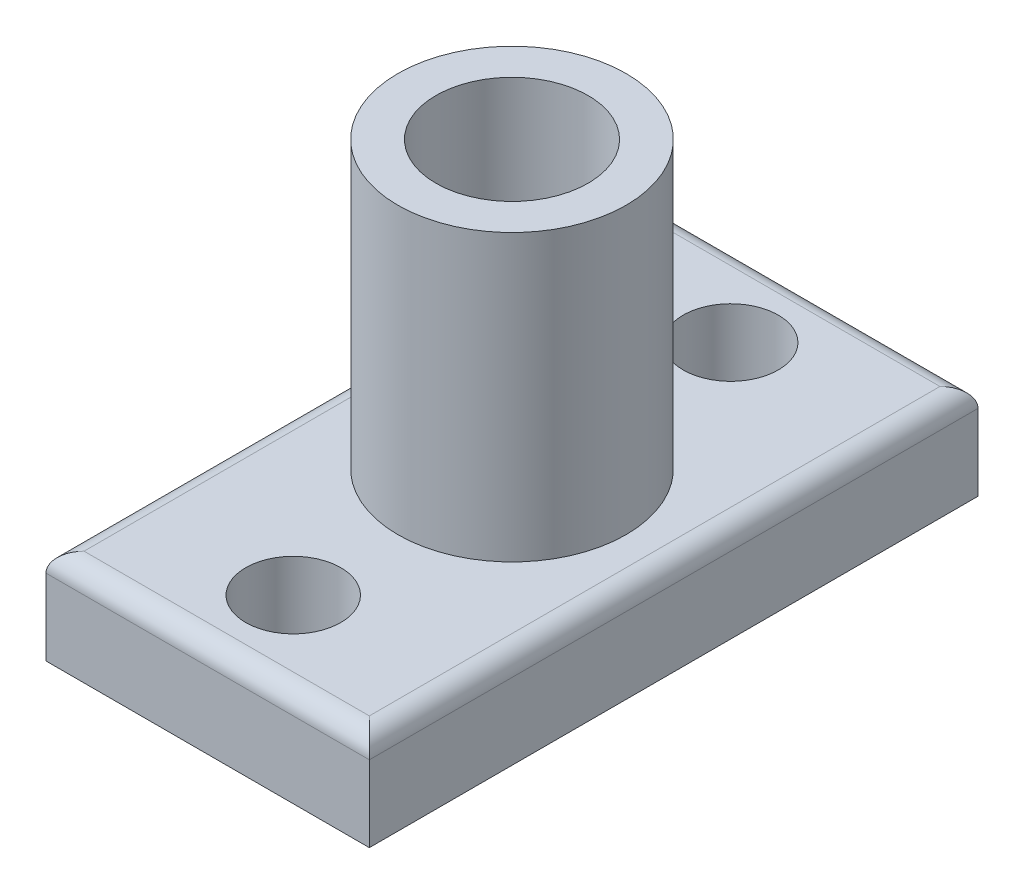
ISO-10303-21;
HEADER;
FILE_DESCRIPTION(('STEP AP214'),'2;1');
FILE_NAME('part.step','',(''),(''),'','','');
FILE_SCHEMA(('AUTOMOTIVE_DESIGN { 1 0 10303 214 1 1 1 1 }'));
ENDSEC;
DATA;
#1=APPLICATION_CONTEXT('core data for automotive mechanical design processes');
#2=APPLICATION_PROTOCOL_DEFINITION('international standard','automotive_design',2000,#1);
#3=PRODUCT_CONTEXT('',#1,'mechanical');
#4=PRODUCT('Part','Part','',(#3));
#5=PRODUCT_RELATED_PRODUCT_CATEGORY('part','',(#4));
#6=PRODUCT_DEFINITION_FORMATION('','',#4);
#7=PRODUCT_DEFINITION_CONTEXT('part definition',#1,'design');
#8=PRODUCT_DEFINITION('design','',#6,#7);
#9=PRODUCT_DEFINITION_SHAPE('','',#8);
#10=(LENGTH_UNIT() NAMED_UNIT(*) SI_UNIT(.MILLI.,.METRE.));
#11=(NAMED_UNIT(*) PLANE_ANGLE_UNIT() SI_UNIT($,.RADIAN.));
#12=(NAMED_UNIT(*) SI_UNIT($,.STERADIAN.) SOLID_ANGLE_UNIT());
#13=UNCERTAINTY_MEASURE_WITH_UNIT(LENGTH_MEASURE(1.E-05),#10,'distance_accuracy_value','');
#14=(GEOMETRIC_REPRESENTATION_CONTEXT(3) GLOBAL_UNCERTAINTY_ASSIGNED_CONTEXT((#13)) GLOBAL_UNIT_ASSIGNED_CONTEXT((#10,
#11,#12)) REPRESENTATION_CONTEXT('',''));
#15=CARTESIAN_POINT('',(0.,0.,0.));
#16=DIRECTION('',(0.,0.,1.));
#17=DIRECTION('',(1.,0.,0.));
#18=AXIS2_PLACEMENT_3D('',#15,#16,#17);
#19=CARTESIAN_POINT('',(0.,5.,0.));
#20=DIRECTION('',(0.,-1.,0.));
#21=DIRECTION('',(0.,0.,-1.));
#22=AXIS2_PLACEMENT_3D('',#19,#20,#21);
#23=PLANE('',#22);
#24=DIRECTION('',(-1.,0.,0.));
#25=VECTOR('',#24,1.);
#26=CARTESIAN_POINT('',(0.,5.,-15.));
#27=LINE('',#26,#25);
#28=CARTESIAN_POINT('',(7.5,5.,-15.));
#29=VERTEX_POINT('',#28);
#30=CARTESIAN_POINT('',(-7.5,5.,-15.));
#31=VERTEX_POINT('',#30);
#32=EDGE_CURVE('E130',#29,#31,#27,.T.);
#33=ORIENTED_EDGE('',*,*,#32,.T.);
#34=DIRECTION('',(0.,0.,1.));
#35=VECTOR('',#34,1.);
#36=CARTESIAN_POINT('',(-7.5,5.,0.));
#37=LINE('',#36,#35);
#38=CARTESIAN_POINT('',(-7.5,5.,15.));
#39=VERTEX_POINT('',#38);
#40=EDGE_CURVE('E133',#31,#39,#37,.T.);
#41=ORIENTED_EDGE('',*,*,#40,.T.);
#42=DIRECTION('',(1.,0.,0.));
#43=VECTOR('',#42,1.);
#44=CARTESIAN_POINT('',(0.,5.,15.));
#45=LINE('',#44,#43);
#46=CARTESIAN_POINT('',(7.5,5.,15.));
#47=VERTEX_POINT('',#46);
#48=EDGE_CURVE('E128',#39,#47,#45,.T.);
#49=ORIENTED_EDGE('',*,*,#48,.T.);
#50=DIRECTION('',(0.,0.,-1.));
#51=VECTOR('',#50,1.);
#52=CARTESIAN_POINT('',(7.5,5.,0.));
#53=LINE('',#52,#51);
#54=EDGE_CURVE('E126',#47,#29,#53,.T.);
#55=ORIENTED_EDGE('',*,*,#54,.T.);
#56=EDGE_LOOP('',(#33,#41,#49,#55));
#57=FACE_BOUND('',#56,.T.);
#58=CARTESIAN_POINT('',(0.,5.,0.));
#59=DIRECTION('',(0.,-1.,0.));
#60=DIRECTION('',(0.,0.,-1.));
#61=AXIS2_PLACEMENT_3D('',#58,#59,#60);
#62=CIRCLE('',#61,6.);
#63=CARTESIAN_POINT('',(0.,5.,-6.));
#64=VERTEX_POINT('',#63);
#65=EDGE_CURVE('E95',#64,#64,#62,.F.);
#66=ORIENTED_EDGE('',*,*,#65,.F.);
#67=EDGE_LOOP('',(#66));
#68=FACE_BOUND('',#67,.T.);
#69=CARTESIAN_POINT('',(0.,5.,-11.5));
#70=DIRECTION('',(0.,1.,0.));
#71=DIRECTION('',(0.,0.,1.));
#72=AXIS2_PLACEMENT_3D('',#69,#70,#71);
#73=CIRCLE('',#72,2.5);
#74=CARTESIAN_POINT('',(0.,5.,-9.));
#75=VERTEX_POINT('',#74);
#76=EDGE_CURVE('E110',#75,#75,#73,.T.);
#77=ORIENTED_EDGE('',*,*,#76,.F.);
#78=EDGE_LOOP('',(#77));
#79=FACE_BOUND('',#78,.T.);
#80=CARTESIAN_POINT('',(0.,5.,11.5));
#81=DIRECTION('',(0.,1.,0.));
#82=DIRECTION('',(0.,0.,1.));
#83=AXIS2_PLACEMENT_3D('',#80,#81,#82);
#84=CIRCLE('',#83,2.5);
#85=CARTESIAN_POINT('',(0.,5.,14.));
#86=VERTEX_POINT('',#85);
#87=EDGE_CURVE('E164',#86,#86,#84,.T.);
#88=ORIENTED_EDGE('',*,*,#87,.F.);
#89=EDGE_LOOP('',(#88));
#90=FACE_BOUND('',#89,.T.);
#91=ADVANCED_FACE('F32',(#57,#68,#79,#90),#23,.F.);
#92=CARTESIAN_POINT('',(0.,0.,0.));
#93=DIRECTION('',(0.,-1.,0.));
#94=DIRECTION('',(0.,0.,-1.));
#95=AXIS2_PLACEMENT_3D('',#92,#93,#94);
#96=PLANE('',#95);
#97=CARTESIAN_POINT('',(0.,0.,-11.5));
#98=DIRECTION('',(0.,1.,0.));
#99=DIRECTION('',(0.,0.,1.));
#100=AXIS2_PLACEMENT_3D('',#97,#98,#99);
#101=CIRCLE('',#100,2.5);
#102=CARTESIAN_POINT('',(0.,0.,-9.));
#103=VERTEX_POINT('',#102);
#104=EDGE_CURVE('E113',#103,#103,#101,.T.);
#105=ORIENTED_EDGE('',*,*,#104,.T.);
#106=EDGE_LOOP('',(#105));
#107=FACE_BOUND('',#106,.T.);
#108=DIRECTION('',(0.,0.,-1.));
#109=VECTOR('',#108,1.);
#110=CARTESIAN_POINT('',(8.5,0.,16.));
#111=LINE('',#110,#109);
#112=CARTESIAN_POINT('',(8.5,0.,16.));
#113=VERTEX_POINT('',#112);
#114=CARTESIAN_POINT('',(8.5,0.,-16.));
#115=VERTEX_POINT('',#114);
#116=EDGE_CURVE('E103',#113,#115,#111,.T.);
#117=ORIENTED_EDGE('',*,*,#116,.F.);
#118=DIRECTION('',(1.,0.,0.));
#119=VECTOR('',#118,1.);
#120=CARTESIAN_POINT('',(-8.5,0.,16.));
#121=LINE('',#120,#119);
#122=CARTESIAN_POINT('',(-8.5,0.,16.));
#123=VERTEX_POINT('',#122);
#124=EDGE_CURVE('E118',#123,#113,#121,.T.);
#125=ORIENTED_EDGE('',*,*,#124,.F.);
#126=DIRECTION('',(0.,0.,1.));
#127=VECTOR('',#126,1.);
#128=CARTESIAN_POINT('',(-8.5,0.,16.));
#129=LINE('',#128,#127);
#130=CARTESIAN_POINT('',(-8.5,0.,-16.));
#131=VERTEX_POINT('',#130);
#132=EDGE_CURVE('E105',#131,#123,#129,.T.);
#133=ORIENTED_EDGE('',*,*,#132,.F.);
#134=DIRECTION('',(-1.,0.,0.));
#135=VECTOR('',#134,1.);
#136=CARTESIAN_POINT('',(-8.5,0.,-16.));
#137=LINE('',#136,#135);
#138=EDGE_CURVE('E90',#115,#131,#137,.T.);
#139=ORIENTED_EDGE('',*,*,#138,.F.);
#140=EDGE_LOOP('',(#117,#125,#133,#139));
#141=FACE_BOUND('',#140,.T.);
#142=CARTESIAN_POINT('',(0.,0.,11.5));
#143=DIRECTION('',(0.,1.,0.));
#144=DIRECTION('',(0.,0.,1.));
#145=AXIS2_PLACEMENT_3D('',#142,#143,#144);
#146=CIRCLE('',#145,2.5);
#147=CARTESIAN_POINT('',(0.,0.,14.));
#148=VERTEX_POINT('',#147);
#149=EDGE_CURVE('E163',#148,#148,#146,.T.);
#150=ORIENTED_EDGE('',*,*,#149,.T.);
#151=EDGE_LOOP('',(#150));
#152=FACE_BOUND('',#151,.T.);
#153=ADVANCED_FACE('F100',(#107,#141,#152),#96,.T.);
#154=CARTESIAN_POINT('',(8.5,5.,16.));
#155=DIRECTION('',(-1.,0.,0.));
#156=DIRECTION('',(0.,0.,1.));
#157=AXIS2_PLACEMENT_3D('',#154,#155,#156);
#158=PLANE('',#157);
#159=DIRECTION('',(0.,-1.,0.));
#160=VECTOR('',#159,1.);
#161=CARTESIAN_POINT('',(8.5,5.,-16.));
#162=LINE('',#161,#160);
#163=CARTESIAN_POINT('',(8.5,4.,-16.));
#164=VERTEX_POINT('',#163);
#165=EDGE_CURVE('E86',#164,#115,#162,.T.);
#166=ORIENTED_EDGE('',*,*,#165,.F.);
#167=DIRECTION('',(0.,0.,-1.));
#168=VECTOR('',#167,1.);
#169=CARTESIAN_POINT('',(8.5,4.,16.));
#170=LINE('',#169,#168);
#171=CARTESIAN_POINT('',(8.5,4.,16.));
#172=VERTEX_POINT('',#171);
#173=EDGE_CURVE('E11',#164,#172,#170,.F.);
#174=ORIENTED_EDGE('',*,*,#173,.T.);
#175=DIRECTION('',(0.,-1.,0.));
#176=VECTOR('',#175,1.);
#177=CARTESIAN_POINT('',(8.5,5.,16.));
#178=LINE('',#177,#176);
#179=EDGE_CURVE('E108',#172,#113,#178,.T.);
#180=ORIENTED_EDGE('',*,*,#179,.T.);
#181=ORIENTED_EDGE('',*,*,#116,.T.);
#182=EDGE_LOOP('',(#166,#174,#180,#181));
#183=FACE_BOUND('',#182,.T.);
#184=ADVANCED_FACE('F107',(#183),#158,.F.);
#185=CARTESIAN_POINT('',(-8.5,5.,-16.));
#186=DIRECTION('',(0.,0.,1.));
#187=DIRECTION('',(1.,0.,0.));
#188=AXIS2_PLACEMENT_3D('',#185,#186,#187);
#189=PLANE('',#188);
#190=DIRECTION('',(0.,-1.,0.));
#191=VECTOR('',#190,1.);
#192=CARTESIAN_POINT('',(-8.5,5.,-16.));
#193=LINE('',#192,#191);
#194=CARTESIAN_POINT('',(-8.5,4.,-16.));
#195=VERTEX_POINT('',#194);
#196=EDGE_CURVE('E96',#195,#131,#193,.T.);
#197=ORIENTED_EDGE('',*,*,#196,.F.);
#198=DIRECTION('',(-1.,0.,0.));
#199=VECTOR('',#198,1.);
#200=CARTESIAN_POINT('',(-8.5,4.,-16.));
#201=LINE('',#200,#199);
#202=EDGE_CURVE('E93',#195,#164,#201,.F.);
#203=ORIENTED_EDGE('',*,*,#202,.T.);
#204=ORIENTED_EDGE('',*,*,#165,.T.);
#205=ORIENTED_EDGE('',*,*,#138,.T.);
#206=EDGE_LOOP('',(#197,#203,#204,#205));
#207=FACE_BOUND('',#206,.T.);
#208=ADVANCED_FACE('F89',(#207),#189,.F.);
#209=CARTESIAN_POINT('',(-8.5,5.,16.));
#210=DIRECTION('',(1.,0.,0.));
#211=DIRECTION('',(0.,0.,-1.));
#212=AXIS2_PLACEMENT_3D('',#209,#210,#211);
#213=PLANE('',#212);
#214=DIRECTION('',(0.,-1.,0.));
#215=VECTOR('',#214,1.);
#216=CARTESIAN_POINT('',(-8.5,5.,16.));
#217=LINE('',#216,#215);
#218=CARTESIAN_POINT('',(-8.5,4.,16.));
#219=VERTEX_POINT('',#218);
#220=EDGE_CURVE('E121',#219,#123,#217,.T.);
#221=ORIENTED_EDGE('',*,*,#220,.F.);
#222=DIRECTION('',(0.,0.,1.));
#223=VECTOR('',#222,1.);
#224=CARTESIAN_POINT('',(-8.5,4.,16.));
#225=LINE('',#224,#223);
#226=EDGE_CURVE('E41',#219,#195,#225,.F.);
#227=ORIENTED_EDGE('',*,*,#226,.T.);
#228=ORIENTED_EDGE('',*,*,#196,.T.);
#229=ORIENTED_EDGE('',*,*,#132,.T.);
#230=EDGE_LOOP('',(#221,#227,#228,#229));
#231=FACE_BOUND('',#230,.T.);
#232=ADVANCED_FACE('F264',(#231),#213,.F.);
#233=CARTESIAN_POINT('',(-8.5,5.,16.));
#234=DIRECTION('',(0.,0.,-1.));
#235=DIRECTION('',(-1.,0.,0.));
#236=AXIS2_PLACEMENT_3D('',#233,#234,#235);
#237=PLANE('',#236);
#238=ORIENTED_EDGE('',*,*,#179,.F.);
#239=DIRECTION('',(1.,0.,0.));
#240=VECTOR('',#239,1.);
#241=CARTESIAN_POINT('',(-8.5,4.,16.));
#242=LINE('',#241,#240);
#243=EDGE_CURVE('E49',#172,#219,#242,.F.);
#244=ORIENTED_EDGE('',*,*,#243,.T.);
#245=ORIENTED_EDGE('',*,*,#220,.T.);
#246=ORIENTED_EDGE('',*,*,#124,.T.);
#247=EDGE_LOOP('',(#238,#244,#245,#246));
#248=FACE_BOUND('',#247,.T.);
#249=ADVANCED_FACE('F183',(#248),#237,.F.);
#250=CARTESIAN_POINT('',(0.,5.,-11.5));
#251=DIRECTION('',(0.,-1.,0.));
#252=DIRECTION('',(0.,0.,-1.));
#253=AXIS2_PLACEMENT_3D('',#250,#251,#252);
#254=CYLINDRICAL_SURFACE('',#253,2.5);
#255=ORIENTED_EDGE('',*,*,#76,.T.);
#256=EDGE_LOOP('',(#255));
#257=FACE_BOUND('',#256,.T.);
#258=ORIENTED_EDGE('',*,*,#104,.F.);
#259=EDGE_LOOP('',(#258));
#260=FACE_BOUND('',#259,.T.);
#261=ADVANCED_FACE('F173',(#257,#260),#254,.F.);
#262=CARTESIAN_POINT('',(0.,5.,11.5));
#263=DIRECTION('',(0.,-1.,0.));
#264=DIRECTION('',(0.,0.,-1.));
#265=AXIS2_PLACEMENT_3D('',#262,#263,#264);
#266=CYLINDRICAL_SURFACE('',#265,2.5);
#267=ORIENTED_EDGE('',*,*,#87,.T.);
#268=EDGE_LOOP('',(#267));
#269=FACE_BOUND('',#268,.T.);
#270=ORIENTED_EDGE('',*,*,#149,.F.);
#271=EDGE_LOOP('',(#270));
#272=FACE_BOUND('',#271,.T.);
#273=ADVANCED_FACE('F170',(#269,#272),#266,.F.);
#274=CARTESIAN_POINT('',(0.,20.,0.));
#275=DIRECTION('',(0.,1.,0.));
#276=DIRECTION('',(0.,0.,1.));
#277=AXIS2_PLACEMENT_3D('',#274,#275,#276);
#278=PLANE('',#277);
#279=CARTESIAN_POINT('',(0.,20.,0.));
#280=DIRECTION('',(0.,1.,0.));
#281=DIRECTION('',(0.,0.,1.));
#282=AXIS2_PLACEMENT_3D('',#279,#280,#281);
#283=CIRCLE('',#282,6.);
#284=CARTESIAN_POINT('',(0.,20.,6.));
#285=VERTEX_POINT('',#284);
#286=EDGE_CURVE('E158',#285,#285,#283,.T.);
#287=ORIENTED_EDGE('',*,*,#286,.T.);
#288=EDGE_LOOP('',(#287));
#289=FACE_BOUND('',#288,.T.);
#290=CARTESIAN_POINT('',(0.,20.,0.));
#291=DIRECTION('',(0.,1.,0.));
#292=DIRECTION('',(0.,0.,1.));
#293=AXIS2_PLACEMENT_3D('',#290,#291,#292);
#294=CIRCLE('',#293,4.);
#295=CARTESIAN_POINT('',(0.,20.,4.));
#296=VERTEX_POINT('',#295);
#297=EDGE_CURVE('E153',#296,#296,#294,.T.);
#298=ORIENTED_EDGE('',*,*,#297,.F.);
#299=EDGE_LOOP('',(#298));
#300=FACE_BOUND('',#299,.T.);
#301=ADVANCED_FACE('F172',(#289,#300),#278,.T.);
#302=CARTESIAN_POINT('',(0.,20.,0.));
#303=DIRECTION('',(0.,-1.,0.));
#304=DIRECTION('',(0.,0.,-1.));
#305=AXIS2_PLACEMENT_3D('',#302,#303,#304);
#306=CYLINDRICAL_SURFACE('',#305,6.);
#307=ORIENTED_EDGE('',*,*,#286,.F.);
#308=EDGE_LOOP('',(#307));
#309=FACE_BOUND('',#308,.T.);
#310=ORIENTED_EDGE('',*,*,#65,.T.);
#311=EDGE_LOOP('',(#310));
#312=FACE_BOUND('',#311,.T.);
#313=ADVANCED_FACE('F180',(#309,#312),#306,.T.);
#314=CARTESIAN_POINT('',(0.,20.,0.));
#315=DIRECTION('',(0.,-1.,0.));
#316=DIRECTION('',(0.,0.,-1.));
#317=AXIS2_PLACEMENT_3D('',#314,#315,#316);
#318=CYLINDRICAL_SURFACE('',#317,4.);
#319=ORIENTED_EDGE('',*,*,#297,.T.);
#320=EDGE_LOOP('',(#319));
#321=FACE_BOUND('',#320,.T.);
#322=CARTESIAN_POINT('',(0.,5.,0.));
#323=DIRECTION('',(0.,1.,0.));
#324=DIRECTION('',(0.,0.,1.));
#325=AXIS2_PLACEMENT_3D('',#322,#323,#324);
#326=CIRCLE('',#325,4.);
#327=CARTESIAN_POINT('',(0.,5.,4.));
#328=VERTEX_POINT('',#327);
#329=EDGE_CURVE('E148',#328,#328,#326,.T.);
#330=ORIENTED_EDGE('',*,*,#329,.F.);
#331=EDGE_LOOP('',(#330));
#332=FACE_BOUND('',#331,.T.);
#333=ADVANCED_FACE('F198',(#321,#332),#318,.F.);
#334=ORIENTED_EDGE('',*,*,#329,.T.);
#335=EDGE_LOOP('',(#334));
#336=FACE_BOUND('',#335,.T.);
#337=ADVANCED_FACE('F190',(#336),#23,.F.);
#338=CARTESIAN_POINT('',(0.,4.,15.));
#339=DIRECTION('',(1.,0.,0.));
#340=DIRECTION('',(0.,0.,-1.));
#341=AXIS2_PLACEMENT_3D('',#338,#339,#340);
#342=CYLINDRICAL_SURFACE('',#341,1.);
#343=CARTESIAN_POINT('',(-7.5,4.,15.));
#344=DIRECTION('',(0.707106781186547,0.,0.707106781186547));
#345=DIRECTION('',(-0.707106781186547,0.,0.707106781186547));
#346=AXIS2_PLACEMENT_3D('',#343,#344,#345);
#347=ELLIPSE('',#346,1.41421356237309,1.);
#348=EDGE_CURVE('E141',#219,#39,#347,.F.);
#349=ORIENTED_EDGE('',*,*,#348,.F.);
#350=ORIENTED_EDGE('',*,*,#243,.F.);
#351=CARTESIAN_POINT('',(7.5,4.,15.));
#352=DIRECTION('',(0.707106781186547,0.,-0.707106781186547));
#353=DIRECTION('',(-0.707106781186547,0.,-0.707106781186547));
#354=AXIS2_PLACEMENT_3D('',#351,#352,#353);
#355=ELLIPSE('',#354,1.41421356237309,1.);
#356=EDGE_CURVE('E36',#47,#172,#355,.T.);
#357=ORIENTED_EDGE('',*,*,#356,.F.);
#358=ORIENTED_EDGE('',*,*,#48,.F.);
#359=EDGE_LOOP('',(#349,#350,#357,#358));
#360=FACE_BOUND('',#359,.T.);
#361=ADVANCED_FACE('F34',(#360),#342,.T.);
#362=CARTESIAN_POINT('',(7.5,4.,0.));
#363=DIRECTION('',(0.,0.,-1.));
#364=DIRECTION('',(-1.,0.,0.));
#365=AXIS2_PLACEMENT_3D('',#362,#363,#364);
#366=CYLINDRICAL_SURFACE('',#365,1.);
#367=ORIENTED_EDGE('',*,*,#356,.T.);
#368=ORIENTED_EDGE('',*,*,#173,.F.);
#369=CARTESIAN_POINT('',(7.5,4.,-15.));
#370=DIRECTION('',(-0.707106781186547,0.,-0.707106781186547));
#371=DIRECTION('',(0.707106781186547,0.,-0.707106781186547));
#372=AXIS2_PLACEMENT_3D('',#369,#370,#371);
#373=ELLIPSE('',#372,1.41421356237309,1.);
#374=EDGE_CURVE('E140',#29,#164,#373,.T.);
#375=ORIENTED_EDGE('',*,*,#374,.F.);
#376=ORIENTED_EDGE('',*,*,#54,.F.);
#377=EDGE_LOOP('',(#367,#368,#375,#376));
#378=FACE_BOUND('',#377,.T.);
#379=ADVANCED_FACE('F203',(#378),#366,.T.);
#380=CARTESIAN_POINT('',(-7.5,4.,0.));
#381=DIRECTION('',(0.,0.,1.));
#382=DIRECTION('',(1.,0.,0.));
#383=AXIS2_PLACEMENT_3D('',#380,#381,#382);
#384=CYLINDRICAL_SURFACE('',#383,1.);
#385=ORIENTED_EDGE('',*,*,#348,.T.);
#386=ORIENTED_EDGE('',*,*,#40,.F.);
#387=CARTESIAN_POINT('',(-7.5,4.,-15.));
#388=DIRECTION('',(-0.707106781186547,0.,0.707106781186547));
#389=DIRECTION('',(0.707106781186547,0.,0.707106781186547));
#390=AXIS2_PLACEMENT_3D('',#387,#388,#389);
#391=ELLIPSE('',#390,1.41421356237309,1.);
#392=EDGE_CURVE('E138',#195,#31,#391,.F.);
#393=ORIENTED_EDGE('',*,*,#392,.F.);
#394=ORIENTED_EDGE('',*,*,#226,.F.);
#395=EDGE_LOOP('',(#385,#386,#393,#394));
#396=FACE_BOUND('',#395,.T.);
#397=ADVANCED_FACE('F292',(#396),#384,.T.);
#398=CARTESIAN_POINT('',(0.,4.,-15.));
#399=DIRECTION('',(-1.,0.,0.));
#400=DIRECTION('',(0.,0.,1.));
#401=AXIS2_PLACEMENT_3D('',#398,#399,#400);
#402=CYLINDRICAL_SURFACE('',#401,1.);
#403=ORIENTED_EDGE('',*,*,#374,.T.);
#404=ORIENTED_EDGE('',*,*,#202,.F.);
#405=ORIENTED_EDGE('',*,*,#392,.T.);
#406=ORIENTED_EDGE('',*,*,#32,.F.);
#407=EDGE_LOOP('',(#403,#404,#405,#406));
#408=FACE_BOUND('',#407,.T.);
#409=ADVANCED_FACE('F300',(#408),#402,.T.);
#410=CLOSED_SHELL('',(#91,#153,#184,#208,#232,#249,#261,#273,#301,#313,#333,#337,#361,#379,#397,#409));
#411=MANIFOLD_SOLID_BREP('B2',#410);
#412=ADVANCED_BREP_SHAPE_REPRESENTATION('',(#18,#411),#14);
#413=SHAPE_DEFINITION_REPRESENTATION(#9,#412);
ENDSEC;
END-ISO-10303-21;
